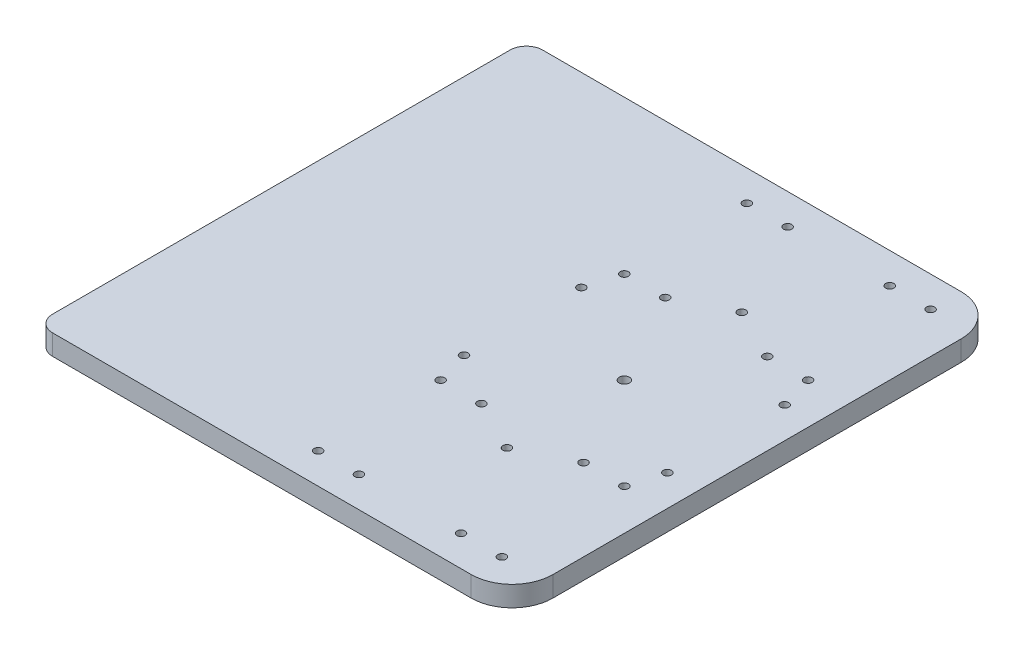
ISO-10303-21;
HEADER;
FILE_DESCRIPTION(('STEP AP214'),'2;1');
FILE_NAME('part.step','',(''),(''),'','','');
FILE_SCHEMA(('AUTOMOTIVE_DESIGN { 1 0 10303 214 1 1 1 1 }'));
ENDSEC;
DATA;
#1=APPLICATION_CONTEXT('core data for automotive mechanical design processes');
#2=APPLICATION_PROTOCOL_DEFINITION('international standard','automotive_design',2000,#1);
#3=PRODUCT_CONTEXT('',#1,'mechanical');
#4=PRODUCT('Part','Part','',(#3));
#5=PRODUCT_RELATED_PRODUCT_CATEGORY('part','',(#4));
#6=PRODUCT_DEFINITION_FORMATION('','',#4);
#7=PRODUCT_DEFINITION_CONTEXT('part definition',#1,'design');
#8=PRODUCT_DEFINITION('design','',#6,#7);
#9=PRODUCT_DEFINITION_SHAPE('','',#8);
#10=(LENGTH_UNIT() NAMED_UNIT(*) SI_UNIT(.MILLI.,.METRE.));
#11=(NAMED_UNIT(*) PLANE_ANGLE_UNIT() SI_UNIT($,.RADIAN.));
#12=(NAMED_UNIT(*) SI_UNIT($,.STERADIAN.) SOLID_ANGLE_UNIT());
#13=UNCERTAINTY_MEASURE_WITH_UNIT(LENGTH_MEASURE(1.E-05),#10,'distance_accuracy_value','');
#14=(GEOMETRIC_REPRESENTATION_CONTEXT(3) GLOBAL_UNCERTAINTY_ASSIGNED_CONTEXT((#13)) GLOBAL_UNIT_ASSIGNED_CONTEXT((#10,
#11,#12)) REPRESENTATION_CONTEXT('',''));
#15=CARTESIAN_POINT('',(0.,0.,0.));
#16=DIRECTION('',(0.,0.,1.));
#17=DIRECTION('',(1.,0.,0.));
#18=AXIS2_PLACEMENT_3D('',#15,#16,#17);
#19=CARTESIAN_POINT('',(-193.,10.,-100.));
#20=DIRECTION('',(0.,1.,0.));
#21=DIRECTION('',(0.,0.,1.));
#22=AXIS2_PLACEMENT_3D('',#19,#20,#21);
#23=PLANE('',#22);
#24=CARTESIAN_POINT('',(-25.,10.,105.));
#25=DIRECTION('',(0.,1.,0.));
#26=DIRECTION('',(0.,0.,-1.));
#27=AXIS2_PLACEMENT_3D('',#24,#25,#26);
#28=CIRCLE('',#27,2.00000000000001);
#29=CARTESIAN_POINT('',(-25.,10.,103.));
#30=VERTEX_POINT('',#29);
#31=EDGE_CURVE('E417',#30,#30,#28,.T.);
#32=ORIENTED_EDGE('',*,*,#31,.F.);
#33=EDGE_LOOP('',(#32));
#34=FACE_BOUND('',#33,.T.);
#35=CARTESIAN_POINT('',(45.,10.,105.));
#36=DIRECTION('',(0.,1.,0.));
#37=DIRECTION('',(0.,0.,-1.));
#38=AXIS2_PLACEMENT_3D('',#35,#36,#37);
#39=CIRCLE('',#38,2.);
#40=CARTESIAN_POINT('',(45.,10.,103.));
#41=VERTEX_POINT('',#40);
#42=EDGE_CURVE('E433',#41,#41,#39,.T.);
#43=ORIENTED_EDGE('',*,*,#42,.F.);
#44=EDGE_LOOP('',(#43));
#45=FACE_BOUND('',#44,.T.);
#46=CARTESIAN_POINT('',(25.,10.,45.));
#47=DIRECTION('',(0.,1.,0.));
#48=DIRECTION('',(0.,0.,-1.));
#49=AXIS2_PLACEMENT_3D('',#46,#47,#48);
#50=CIRCLE('',#49,2.00000000000001);
#51=CARTESIAN_POINT('',(25.,10.,43.));
#52=VERTEX_POINT('',#51);
#53=EDGE_CURVE('E447',#52,#52,#50,.T.);
#54=ORIENTED_EDGE('',*,*,#53,.F.);
#55=EDGE_LOOP('',(#54));
#56=FACE_BOUND('',#55,.T.);
#57=CARTESIAN_POINT('',(-45.,10.,45.));
#58=DIRECTION('',(0.,1.,0.));
#59=DIRECTION('',(0.,0.,-1.));
#60=AXIS2_PLACEMENT_3D('',#57,#58,#59);
#61=CIRCLE('',#60,2.);
#62=CARTESIAN_POINT('',(-45.,10.,43.));
#63=VERTEX_POINT('',#62);
#64=EDGE_CURVE('E461',#63,#63,#61,.T.);
#65=ORIENTED_EDGE('',*,*,#64,.F.);
#66=EDGE_LOOP('',(#65));
#67=FACE_BOUND('',#66,.T.);
#68=CARTESIAN_POINT('',(25.,10.,-45.));
#69=DIRECTION('',(0.,1.,0.));
#70=DIRECTION('',(0.,0.,1.));
#71=AXIS2_PLACEMENT_3D('',#68,#69,#70);
#72=CIRCLE('',#71,2.00000000000001);
#73=CARTESIAN_POINT('',(25.,10.,-43.));
#74=VERTEX_POINT('',#73);
#75=EDGE_CURVE('E475',#74,#74,#72,.T.);
#76=ORIENTED_EDGE('',*,*,#75,.F.);
#77=EDGE_LOOP('',(#76));
#78=FACE_BOUND('',#77,.T.);
#79=CARTESIAN_POINT('',(-45.,10.,-45.));
#80=DIRECTION('',(0.,1.,0.));
#81=DIRECTION('',(0.,0.,1.));
#82=AXIS2_PLACEMENT_3D('',#79,#80,#81);
#83=CIRCLE('',#82,2.);
#84=CARTESIAN_POINT('',(-45.,10.,-43.));
#85=VERTEX_POINT('',#84);
#86=EDGE_CURVE('E489',#85,#85,#83,.T.);
#87=ORIENTED_EDGE('',*,*,#86,.F.);
#88=EDGE_LOOP('',(#87));
#89=FACE_BOUND('',#88,.T.);
#90=CARTESIAN_POINT('',(25.,10.,-105.));
#91=DIRECTION('',(0.,1.,0.));
#92=DIRECTION('',(0.,0.,1.));
#93=AXIS2_PLACEMENT_3D('',#90,#91,#92);
#94=CIRCLE('',#93,2.00000000000001);
#95=CARTESIAN_POINT('',(25.,10.,-103.));
#96=VERTEX_POINT('',#95);
#97=EDGE_CURVE('E503',#96,#96,#94,.T.);
#98=ORIENTED_EDGE('',*,*,#97,.F.);
#99=EDGE_LOOP('',(#98));
#100=FACE_BOUND('',#99,.T.);
#101=CARTESIAN_POINT('',(-45.,10.,-105.));
#102=DIRECTION('',(0.,1.,0.));
#103=DIRECTION('',(0.,0.,1.));
#104=AXIS2_PLACEMENT_3D('',#101,#102,#103);
#105=CIRCLE('',#104,2.);
#106=CARTESIAN_POINT('',(-45.,10.,-103.));
#107=VERTEX_POINT('',#106);
#108=EDGE_CURVE('E517',#107,#107,#105,.T.);
#109=ORIENTED_EDGE('',*,*,#108,.F.);
#110=EDGE_LOOP('',(#109));
#111=FACE_BOUND('',#110,.T.);
#112=CARTESIAN_POINT('',(49.7964607176055,10.,-28.7499999999995));
#113=DIRECTION('',(0.,1.,0.));
#114=DIRECTION('',(0.,0.,1.));
#115=AXIS2_PLACEMENT_3D('',#112,#113,#114);
#116=CIRCLE('',#115,2.);
#117=CARTESIAN_POINT('',(49.7964607176055,10.,-26.7499999999995));
#118=VERTEX_POINT('',#117);
#119=EDGE_CURVE('E531',#118,#118,#116,.T.);
#120=ORIENTED_EDGE('',*,*,#119,.F.);
#121=EDGE_LOOP('',(#120));
#122=FACE_BOUND('',#121,.T.);
#123=CARTESIAN_POINT('',(-49.7964607176051,10.,-28.7500000000002));
#124=DIRECTION('',(0.,1.,0.));
#125=DIRECTION('',(0.,0.,1.));
#126=AXIS2_PLACEMENT_3D('',#123,#124,#125);
#127=CIRCLE('',#126,2.);
#128=CARTESIAN_POINT('',(-49.7964607176051,10.,-26.7500000000002));
#129=VERTEX_POINT('',#128);
#130=EDGE_CURVE('E545',#129,#129,#127,.T.);
#131=ORIENTED_EDGE('',*,*,#130,.F.);
#132=EDGE_LOOP('',(#131));
#133=FACE_BOUND('',#132,.T.);
#134=CARTESIAN_POINT('',(0.,10.,0.));
#135=DIRECTION('',(0.,1.,0.));
#136=DIRECTION('',(0.,0.,1.));
#137=AXIS2_PLACEMENT_3D('',#134,#135,#136);
#138=CIRCLE('',#137,2.5);
#139=CARTESIAN_POINT('',(0.,10.,2.5));
#140=VERTEX_POINT('',#139);
#141=EDGE_CURVE('E343',#140,#140,#138,.T.);
#142=ORIENTED_EDGE('',*,*,#141,.F.);
#143=EDGE_LOOP('',(#142));
#144=FACE_BOUND('',#143,.T.);
#145=CARTESIAN_POINT('',(0.,10.,57.5));
#146=DIRECTION('',(0.,1.,0.));
#147=DIRECTION('',(0.,0.,1.));
#148=AXIS2_PLACEMENT_3D('',#145,#146,#147);
#149=CIRCLE('',#148,2.);
#150=CARTESIAN_POINT('',(0.,10.,59.5));
#151=VERTEX_POINT('',#150);
#152=EDGE_CURVE('E144',#151,#151,#149,.T.);
#153=ORIENTED_EDGE('',*,*,#152,.F.);
#154=EDGE_LOOP('',(#153));
#155=FACE_BOUND('',#154,.T.);
#156=CARTESIAN_POINT('',(-49.7964607176053,10.,28.7499999999999));
#157=DIRECTION('',(0.,1.,0.));
#158=DIRECTION('',(0.,0.,1.));
#159=AXIS2_PLACEMENT_3D('',#156,#157,#158);
#160=CIRCLE('',#159,2.);
#161=CARTESIAN_POINT('',(-49.7964607176053,10.,30.7499999999999));
#162=VERTEX_POINT('',#161);
#163=EDGE_CURVE('E349',#162,#162,#160,.T.);
#164=ORIENTED_EDGE('',*,*,#163,.F.);
#165=EDGE_LOOP('',(#164));
#166=FACE_BOUND('',#165,.T.);
#167=CARTESIAN_POINT('',(4.0152035396696E-13,10.,-57.5));
#168=DIRECTION('',(0.,1.,0.));
#169=DIRECTION('',(0.,0.,1.));
#170=AXIS2_PLACEMENT_3D('',#167,#168,#169);
#171=CIRCLE('',#170,2.);
#172=CARTESIAN_POINT('',(4.0152035396696E-13,10.,-55.5));
#173=VERTEX_POINT('',#172);
#174=EDGE_CURVE('E375',#173,#173,#171,.T.);
#175=ORIENTED_EDGE('',*,*,#174,.F.);
#176=EDGE_LOOP('',(#175));
#177=FACE_BOUND('',#176,.T.);
#178=CARTESIAN_POINT('',(49.7964607176049,10.,28.7500000000006));
#179=DIRECTION('',(0.,1.,0.));
#180=DIRECTION('',(0.,0.,1.));
#181=AXIS2_PLACEMENT_3D('',#178,#179,#180);
#182=CIRCLE('',#181,2.);
#183=CARTESIAN_POINT('',(49.7964607176049,10.,30.7500000000006));
#184=VERTEX_POINT('',#183);
#185=EDGE_CURVE('E379',#184,#184,#182,.T.);
#186=ORIENTED_EDGE('',*,*,#185,.F.);
#187=EDGE_LOOP('',(#186));
#188=FACE_BOUND('',#187,.T.);
#189=CARTESIAN_POINT('',(-25.,10.,-105.));
#190=DIRECTION('',(0.,1.,0.));
#191=DIRECTION('',(0.,0.,1.));
#192=AXIS2_PLACEMENT_3D('',#189,#190,#191);
#193=CIRCLE('',#192,2.00000000000001);
#194=CARTESIAN_POINT('',(-25.,10.,-103.));
#195=VERTEX_POINT('',#194);
#196=EDGE_CURVE('E383',#195,#195,#193,.T.);
#197=ORIENTED_EDGE('',*,*,#196,.F.);
#198=EDGE_LOOP('',(#197));
#199=FACE_BOUND('',#198,.T.);
#200=CARTESIAN_POINT('',(45.,10.,-105.));
#201=DIRECTION('',(0.,1.,0.));
#202=DIRECTION('',(0.,0.,1.));
#203=AXIS2_PLACEMENT_3D('',#200,#201,#202);
#204=CIRCLE('',#203,2.);
#205=CARTESIAN_POINT('',(45.,10.,-103.));
#206=VERTEX_POINT('',#205);
#207=EDGE_CURVE('E387',#206,#206,#204,.T.);
#208=ORIENTED_EDGE('',*,*,#207,.F.);
#209=EDGE_LOOP('',(#208));
#210=FACE_BOUND('',#209,.T.);
#211=CARTESIAN_POINT('',(-25.,10.,-45.));
#212=DIRECTION('',(0.,1.,0.));
#213=DIRECTION('',(0.,0.,1.));
#214=AXIS2_PLACEMENT_3D('',#211,#212,#213);
#215=CIRCLE('',#214,2.00000000000001);
#216=CARTESIAN_POINT('',(-25.,10.,-43.));
#217=VERTEX_POINT('',#216);
#218=EDGE_CURVE('E391',#217,#217,#215,.T.);
#219=ORIENTED_EDGE('',*,*,#218,.F.);
#220=EDGE_LOOP('',(#219));
#221=FACE_BOUND('',#220,.T.);
#222=CARTESIAN_POINT('',(45.,10.,-45.));
#223=DIRECTION('',(0.,1.,0.));
#224=DIRECTION('',(0.,0.,1.));
#225=AXIS2_PLACEMENT_3D('',#222,#223,#224);
#226=CIRCLE('',#225,2.);
#227=CARTESIAN_POINT('',(45.,10.,-43.));
#228=VERTEX_POINT('',#227);
#229=EDGE_CURVE('E395',#228,#228,#226,.T.);
#230=ORIENTED_EDGE('',*,*,#229,.F.);
#231=EDGE_LOOP('',(#230));
#232=FACE_BOUND('',#231,.T.);
#233=CARTESIAN_POINT('',(-25.,10.,45.));
#234=DIRECTION('',(0.,1.,0.));
#235=DIRECTION('',(0.,0.,-1.));
#236=AXIS2_PLACEMENT_3D('',#233,#234,#235);
#237=CIRCLE('',#236,2.00000000000001);
#238=CARTESIAN_POINT('',(-25.,10.,43.));
#239=VERTEX_POINT('',#238);
#240=EDGE_CURVE('E399',#239,#239,#237,.T.);
#241=ORIENTED_EDGE('',*,*,#240,.F.);
#242=EDGE_LOOP('',(#241));
#243=FACE_BOUND('',#242,.T.);
#244=CARTESIAN_POINT('',(45.,10.,45.));
#245=DIRECTION('',(0.,1.,0.));
#246=DIRECTION('',(0.,0.,-1.));
#247=AXIS2_PLACEMENT_3D('',#244,#245,#246);
#248=CIRCLE('',#247,2.);
#249=CARTESIAN_POINT('',(45.,10.,43.));
#250=VERTEX_POINT('',#249);
#251=EDGE_CURVE('E403',#250,#250,#248,.T.);
#252=ORIENTED_EDGE('',*,*,#251,.F.);
#253=EDGE_LOOP('',(#252));
#254=FACE_BOUND('',#253,.T.);
#255=CARTESIAN_POINT('',(25.,10.,105.));
#256=DIRECTION('',(0.,1.,0.));
#257=DIRECTION('',(0.,0.,-1.));
#258=AXIS2_PLACEMENT_3D('',#255,#256,#257);
#259=CIRCLE('',#258,2.00000000000001);
#260=CARTESIAN_POINT('',(25.,10.,103.));
#261=VERTEX_POINT('',#260);
#262=EDGE_CURVE('E407',#261,#261,#259,.T.);
#263=ORIENTED_EDGE('',*,*,#262,.F.);
#264=EDGE_LOOP('',(#263));
#265=FACE_BOUND('',#264,.T.);
#266=CARTESIAN_POINT('',(-45.,10.,105.));
#267=DIRECTION('',(0.,1.,0.));
#268=DIRECTION('',(0.,0.,-1.));
#269=AXIS2_PLACEMENT_3D('',#266,#267,#268);
#270=CIRCLE('',#269,2.);
#271=CARTESIAN_POINT('',(-45.,10.,103.));
#272=VERTEX_POINT('',#271);
#273=EDGE_CURVE('E410',#272,#272,#270,.T.);
#274=ORIENTED_EDGE('',*,*,#273,.F.);
#275=EDGE_LOOP('',(#274));
#276=FACE_BOUND('',#275,.T.);
#277=DIRECTION('',(-1.,0.,0.));
#278=VECTOR('',#277,1.);
#279=CARTESIAN_POINT('',(-193.,10.,-120.));
#280=LINE('',#279,#278);
#281=CARTESIAN_POINT('',(45.,10.,-120.));
#282=VERTEX_POINT('',#281);
#283=CARTESIAN_POINT('',(-160.,10.,-120.));
#284=VERTEX_POINT('',#283);
#285=EDGE_CURVE('E137',#282,#284,#280,.T.);
#286=ORIENTED_EDGE('',*,*,#285,.T.);
#287=CARTESIAN_POINT('',(-160.,10.,-112.));
#288=DIRECTION('',(0.,1.,0.));
#289=DIRECTION('',(0.,0.,1.));
#290=AXIS2_PLACEMENT_3D('',#287,#288,#289);
#291=CIRCLE('',#290,8.);
#292=CARTESIAN_POINT('',(-168.,10.,-112.));
#293=VERTEX_POINT('',#292);
#294=EDGE_CURVE('E48',#284,#293,#291,.T.);
#295=ORIENTED_EDGE('',*,*,#294,.T.);
#296=DIRECTION('',(0.,0.,-1.));
#297=VECTOR('',#296,1.);
#298=CARTESIAN_POINT('',(-168.,10.,-120.));
#299=LINE('',#298,#297);
#300=CARTESIAN_POINT('',(-168.,10.,112.));
#301=VERTEX_POINT('',#300);
#302=EDGE_CURVE('E183',#301,#293,#299,.T.);
#303=ORIENTED_EDGE('',*,*,#302,.F.);
#304=CARTESIAN_POINT('',(-160.,10.,112.));
#305=DIRECTION('',(0.,1.,0.));
#306=DIRECTION('',(0.,0.,1.));
#307=AXIS2_PLACEMENT_3D('',#304,#305,#306);
#308=CIRCLE('',#307,8.);
#309=CARTESIAN_POINT('',(-160.,10.,120.));
#310=VERTEX_POINT('',#309);
#311=EDGE_CURVE('E55',#301,#310,#308,.T.);
#312=ORIENTED_EDGE('',*,*,#311,.T.);
#313=DIRECTION('',(1.,0.,0.));
#314=VECTOR('',#313,1.);
#315=CARTESIAN_POINT('',(45.,10.,120.));
#316=LINE('',#315,#314);
#317=CARTESIAN_POINT('',(45.,10.,120.));
#318=VERTEX_POINT('',#317);
#319=EDGE_CURVE('E103',#310,#318,#316,.T.);
#320=ORIENTED_EDGE('',*,*,#319,.T.);
#321=CARTESIAN_POINT('',(45.,10.,100.));
#322=DIRECTION('',(0.,1.,0.));
#323=DIRECTION('',(0.,0.,-1.));
#324=AXIS2_PLACEMENT_3D('',#321,#322,#323);
#325=CIRCLE('',#324,20.);
#326=CARTESIAN_POINT('',(65.,10.,100.));
#327=VERTEX_POINT('',#326);
#328=EDGE_CURVE('E106',#318,#327,#325,.T.);
#329=ORIENTED_EDGE('',*,*,#328,.T.);
#330=DIRECTION('',(0.,0.,-1.));
#331=VECTOR('',#330,1.);
#332=CARTESIAN_POINT('',(65.,10.,-100.));
#333=LINE('',#332,#331);
#334=CARTESIAN_POINT('',(65.,10.,-100.));
#335=VERTEX_POINT('',#334);
#336=EDGE_CURVE('E128',#327,#335,#333,.T.);
#337=ORIENTED_EDGE('',*,*,#336,.T.);
#338=CARTESIAN_POINT('',(45.,10.,-100.));
#339=DIRECTION('',(0.,1.,0.));
#340=DIRECTION('',(0.,0.,1.));
#341=AXIS2_PLACEMENT_3D('',#338,#339,#340);
#342=CIRCLE('',#341,20.);
#343=EDGE_CURVE('E131',#335,#282,#342,.T.);
#344=ORIENTED_EDGE('',*,*,#343,.T.);
#345=EDGE_LOOP('',(#286,#295,#303,#312,#320,#329,#337,#344));
#346=FACE_BOUND('',#345,.T.);
#347=ADVANCED_FACE('F39',(#34,#45,#56,#67,#78,#89,#100,#111,#122,#133,#144,#155,#166,#177,#188,
#199,#210,#221,#232,#243,#254,#265,#276,#346),#23,.T.);
#348=CARTESIAN_POINT('',(-193.,0.,-100.));
#349=DIRECTION('',(0.,1.,0.));
#350=DIRECTION('',(0.,0.,1.));
#351=AXIS2_PLACEMENT_3D('',#348,#349,#350);
#352=PLANE('',#351);
#353=CARTESIAN_POINT('',(-45.,0.,105.));
#354=DIRECTION('',(0.,1.,0.));
#355=DIRECTION('',(0.,0.,-1.));
#356=AXIS2_PLACEMENT_3D('',#353,#354,#355);
#357=CIRCLE('',#356,2.);
#358=CARTESIAN_POINT('',(-45.,0.,103.));
#359=VERTEX_POINT('',#358);
#360=EDGE_CURVE('E192',#359,#359,#357,.T.);
#361=ORIENTED_EDGE('',*,*,#360,.T.);
#362=EDGE_LOOP('',(#361));
#363=FACE_BOUND('',#362,.T.);
#364=CARTESIAN_POINT('',(-25.,0.,105.));
#365=DIRECTION('',(0.,1.,0.));
#366=DIRECTION('',(0.,0.,-1.));
#367=AXIS2_PLACEMENT_3D('',#364,#365,#366);
#368=CIRCLE('',#367,2.00000000000001);
#369=CARTESIAN_POINT('',(-25.,0.,103.));
#370=VERTEX_POINT('',#369);
#371=EDGE_CURVE('E412',#370,#370,#368,.T.);
#372=ORIENTED_EDGE('',*,*,#371,.T.);
#373=EDGE_LOOP('',(#372));
#374=FACE_BOUND('',#373,.T.);
#375=CARTESIAN_POINT('',(25.,0.,105.));
#376=DIRECTION('',(0.,1.,0.));
#377=DIRECTION('',(0.,0.,-1.));
#378=AXIS2_PLACEMENT_3D('',#375,#376,#377);
#379=CIRCLE('',#378,2.00000000000001);
#380=CARTESIAN_POINT('',(25.,0.,103.));
#381=VERTEX_POINT('',#380);
#382=EDGE_CURVE('E425',#381,#381,#379,.T.);
#383=ORIENTED_EDGE('',*,*,#382,.T.);
#384=EDGE_LOOP('',(#383));
#385=FACE_BOUND('',#384,.T.);
#386=CARTESIAN_POINT('',(45.,0.,105.));
#387=DIRECTION('',(0.,1.,0.));
#388=DIRECTION('',(0.,0.,-1.));
#389=AXIS2_PLACEMENT_3D('',#386,#387,#388);
#390=CIRCLE('',#389,2.);
#391=CARTESIAN_POINT('',(45.,0.,103.));
#392=VERTEX_POINT('',#391);
#393=EDGE_CURVE('E429',#392,#392,#390,.T.);
#394=ORIENTED_EDGE('',*,*,#393,.T.);
#395=EDGE_LOOP('',(#394));
#396=FACE_BOUND('',#395,.T.);
#397=CARTESIAN_POINT('',(45.,0.,45.));
#398=DIRECTION('',(0.,1.,0.));
#399=DIRECTION('',(0.,0.,-1.));
#400=AXIS2_PLACEMENT_3D('',#397,#398,#399);
#401=CIRCLE('',#400,2.);
#402=CARTESIAN_POINT('',(45.,0.,43.));
#403=VERTEX_POINT('',#402);
#404=EDGE_CURVE('E437',#403,#403,#401,.T.);
#405=ORIENTED_EDGE('',*,*,#404,.T.);
#406=EDGE_LOOP('',(#405));
#407=FACE_BOUND('',#406,.T.);
#408=CARTESIAN_POINT('',(25.,0.,45.));
#409=DIRECTION('',(0.,1.,0.));
#410=DIRECTION('',(0.,0.,-1.));
#411=AXIS2_PLACEMENT_3D('',#408,#409,#410);
#412=CIRCLE('',#411,2.00000000000001);
#413=CARTESIAN_POINT('',(25.,0.,43.));
#414=VERTEX_POINT('',#413);
#415=EDGE_CURVE('E443',#414,#414,#412,.T.);
#416=ORIENTED_EDGE('',*,*,#415,.T.);
#417=EDGE_LOOP('',(#416));
#418=FACE_BOUND('',#417,.T.);
#419=CARTESIAN_POINT('',(-25.,0.,45.));
#420=DIRECTION('',(0.,1.,0.));
#421=DIRECTION('',(0.,0.,-1.));
#422=AXIS2_PLACEMENT_3D('',#419,#420,#421);
#423=CIRCLE('',#422,2.00000000000001);
#424=CARTESIAN_POINT('',(-25.,0.,43.));
#425=VERTEX_POINT('',#424);
#426=EDGE_CURVE('E451',#425,#425,#423,.T.);
#427=ORIENTED_EDGE('',*,*,#426,.T.);
#428=EDGE_LOOP('',(#427));
#429=FACE_BOUND('',#428,.T.);
#430=CARTESIAN_POINT('',(-45.,0.,45.));
#431=DIRECTION('',(0.,1.,0.));
#432=DIRECTION('',(0.,0.,-1.));
#433=AXIS2_PLACEMENT_3D('',#430,#431,#432);
#434=CIRCLE('',#433,2.);
#435=CARTESIAN_POINT('',(-45.,0.,43.));
#436=VERTEX_POINT('',#435);
#437=EDGE_CURVE('E457',#436,#436,#434,.T.);
#438=ORIENTED_EDGE('',*,*,#437,.T.);
#439=EDGE_LOOP('',(#438));
#440=FACE_BOUND('',#439,.T.);
#441=CARTESIAN_POINT('',(45.,0.,-45.));
#442=DIRECTION('',(0.,1.,0.));
#443=DIRECTION('',(0.,0.,1.));
#444=AXIS2_PLACEMENT_3D('',#441,#442,#443);
#445=CIRCLE('',#444,2.);
#446=CARTESIAN_POINT('',(45.,0.,-43.));
#447=VERTEX_POINT('',#446);
#448=EDGE_CURVE('E465',#447,#447,#445,.T.);
#449=ORIENTED_EDGE('',*,*,#448,.T.);
#450=EDGE_LOOP('',(#449));
#451=FACE_BOUND('',#450,.T.);
#452=CARTESIAN_POINT('',(25.,0.,-45.));
#453=DIRECTION('',(0.,1.,0.));
#454=DIRECTION('',(0.,0.,1.));
#455=AXIS2_PLACEMENT_3D('',#452,#453,#454);
#456=CIRCLE('',#455,2.00000000000001);
#457=CARTESIAN_POINT('',(25.,0.,-43.));
#458=VERTEX_POINT('',#457);
#459=EDGE_CURVE('E471',#458,#458,#456,.T.);
#460=ORIENTED_EDGE('',*,*,#459,.T.);
#461=EDGE_LOOP('',(#460));
#462=FACE_BOUND('',#461,.T.);
#463=CARTESIAN_POINT('',(-25.,0.,-45.));
#464=DIRECTION('',(0.,1.,0.));
#465=DIRECTION('',(0.,0.,1.));
#466=AXIS2_PLACEMENT_3D('',#463,#464,#465);
#467=CIRCLE('',#466,2.00000000000001);
#468=CARTESIAN_POINT('',(-25.,0.,-43.));
#469=VERTEX_POINT('',#468);
#470=EDGE_CURVE('E479',#469,#469,#467,.T.);
#471=ORIENTED_EDGE('',*,*,#470,.T.);
#472=EDGE_LOOP('',(#471));
#473=FACE_BOUND('',#472,.T.);
#474=CARTESIAN_POINT('',(-45.,0.,-45.));
#475=DIRECTION('',(0.,1.,0.));
#476=DIRECTION('',(0.,0.,1.));
#477=AXIS2_PLACEMENT_3D('',#474,#475,#476);
#478=CIRCLE('',#477,2.);
#479=CARTESIAN_POINT('',(-45.,0.,-43.));
#480=VERTEX_POINT('',#479);
#481=EDGE_CURVE('E485',#480,#480,#478,.T.);
#482=ORIENTED_EDGE('',*,*,#481,.T.);
#483=EDGE_LOOP('',(#482));
#484=FACE_BOUND('',#483,.T.);
#485=CARTESIAN_POINT('',(45.,0.,-105.));
#486=DIRECTION('',(0.,1.,0.));
#487=DIRECTION('',(0.,0.,1.));
#488=AXIS2_PLACEMENT_3D('',#485,#486,#487);
#489=CIRCLE('',#488,2.);
#490=CARTESIAN_POINT('',(45.,0.,-103.));
#491=VERTEX_POINT('',#490);
#492=EDGE_CURVE('E493',#491,#491,#489,.T.);
#493=ORIENTED_EDGE('',*,*,#492,.T.);
#494=EDGE_LOOP('',(#493));
#495=FACE_BOUND('',#494,.T.);
#496=CARTESIAN_POINT('',(25.,0.,-105.));
#497=DIRECTION('',(0.,1.,0.));
#498=DIRECTION('',(0.,0.,1.));
#499=AXIS2_PLACEMENT_3D('',#496,#497,#498);
#500=CIRCLE('',#499,2.00000000000001);
#501=CARTESIAN_POINT('',(25.,0.,-103.));
#502=VERTEX_POINT('',#501);
#503=EDGE_CURVE('E499',#502,#502,#500,.T.);
#504=ORIENTED_EDGE('',*,*,#503,.T.);
#505=EDGE_LOOP('',(#504));
#506=FACE_BOUND('',#505,.T.);
#507=CARTESIAN_POINT('',(-25.,0.,-105.));
#508=DIRECTION('',(0.,1.,0.));
#509=DIRECTION('',(0.,0.,1.));
#510=AXIS2_PLACEMENT_3D('',#507,#508,#509);
#511=CIRCLE('',#510,2.00000000000001);
#512=CARTESIAN_POINT('',(-25.,0.,-103.));
#513=VERTEX_POINT('',#512);
#514=EDGE_CURVE('E507',#513,#513,#511,.T.);
#515=ORIENTED_EDGE('',*,*,#514,.T.);
#516=EDGE_LOOP('',(#515));
#517=FACE_BOUND('',#516,.T.);
#518=CARTESIAN_POINT('',(-45.,0.,-105.));
#519=DIRECTION('',(0.,1.,0.));
#520=DIRECTION('',(0.,0.,1.));
#521=AXIS2_PLACEMENT_3D('',#518,#519,#520);
#522=CIRCLE('',#521,2.);
#523=CARTESIAN_POINT('',(-45.,0.,-103.));
#524=VERTEX_POINT('',#523);
#525=EDGE_CURVE('E513',#524,#524,#522,.T.);
#526=ORIENTED_EDGE('',*,*,#525,.T.);
#527=EDGE_LOOP('',(#526));
#528=FACE_BOUND('',#527,.T.);
#529=CARTESIAN_POINT('',(49.7964607176049,0.,28.7500000000006));
#530=DIRECTION('',(0.,1.,0.));
#531=DIRECTION('',(0.,0.,1.));
#532=AXIS2_PLACEMENT_3D('',#529,#530,#531);
#533=CIRCLE('',#532,2.);
#534=CARTESIAN_POINT('',(49.7964607176049,0.,30.7500000000006));
#535=VERTEX_POINT('',#534);
#536=EDGE_CURVE('E521',#535,#535,#533,.T.);
#537=ORIENTED_EDGE('',*,*,#536,.T.);
#538=EDGE_LOOP('',(#537));
#539=FACE_BOUND('',#538,.T.);
#540=CARTESIAN_POINT('',(49.7964607176055,0.,-28.7499999999995));
#541=DIRECTION('',(0.,1.,0.));
#542=DIRECTION('',(0.,0.,1.));
#543=AXIS2_PLACEMENT_3D('',#540,#541,#542);
#544=CIRCLE('',#543,2.);
#545=CARTESIAN_POINT('',(49.7964607176055,0.,-26.7499999999995));
#546=VERTEX_POINT('',#545);
#547=EDGE_CURVE('E527',#546,#546,#544,.T.);
#548=ORIENTED_EDGE('',*,*,#547,.T.);
#549=EDGE_LOOP('',(#548));
#550=FACE_BOUND('',#549,.T.);
#551=CARTESIAN_POINT('',(4.0152035396696E-13,0.,-57.5));
#552=DIRECTION('',(0.,1.,0.));
#553=DIRECTION('',(0.,0.,1.));
#554=AXIS2_PLACEMENT_3D('',#551,#552,#553);
#555=CIRCLE('',#554,2.);
#556=CARTESIAN_POINT('',(4.0152035396696E-13,0.,-55.5));
#557=VERTEX_POINT('',#556);
#558=EDGE_CURVE('E535',#557,#557,#555,.T.);
#559=ORIENTED_EDGE('',*,*,#558,.T.);
#560=EDGE_LOOP('',(#559));
#561=FACE_BOUND('',#560,.T.);
#562=CARTESIAN_POINT('',(-49.7964607176051,0.,-28.7500000000002));
#563=DIRECTION('',(0.,1.,0.));
#564=DIRECTION('',(0.,0.,1.));
#565=AXIS2_PLACEMENT_3D('',#562,#563,#564);
#566=CIRCLE('',#565,2.);
#567=CARTESIAN_POINT('',(-49.7964607176051,0.,-26.7500000000002));
#568=VERTEX_POINT('',#567);
#569=EDGE_CURVE('E541',#568,#568,#566,.T.);
#570=ORIENTED_EDGE('',*,*,#569,.T.);
#571=EDGE_LOOP('',(#570));
#572=FACE_BOUND('',#571,.T.);
#573=CARTESIAN_POINT('',(-49.7964607176053,0.,28.7499999999999));
#574=DIRECTION('',(0.,1.,0.));
#575=DIRECTION('',(0.,0.,1.));
#576=AXIS2_PLACEMENT_3D('',#573,#574,#575);
#577=CIRCLE('',#576,2.);
#578=CARTESIAN_POINT('',(-49.7964607176053,0.,30.7499999999999));
#579=VERTEX_POINT('',#578);
#580=EDGE_CURVE('E356',#579,#579,#577,.T.);
#581=ORIENTED_EDGE('',*,*,#580,.T.);
#582=EDGE_LOOP('',(#581));
#583=FACE_BOUND('',#582,.T.);
#584=CARTESIAN_POINT('',(0.,0.,0.));
#585=DIRECTION('',(0.,1.,0.));
#586=DIRECTION('',(0.,0.,1.));
#587=AXIS2_PLACEMENT_3D('',#584,#585,#586);
#588=CIRCLE('',#587,2.5);
#589=CARTESIAN_POINT('',(0.,0.,2.5));
#590=VERTEX_POINT('',#589);
#591=EDGE_CURVE('E346',#590,#590,#588,.T.);
#592=ORIENTED_EDGE('',*,*,#591,.T.);
#593=EDGE_LOOP('',(#592));
#594=FACE_BOUND('',#593,.T.);
#595=CARTESIAN_POINT('',(0.,0.,57.5));
#596=DIRECTION('',(0.,1.,0.));
#597=DIRECTION('',(0.,0.,1.));
#598=AXIS2_PLACEMENT_3D('',#595,#596,#597);
#599=CIRCLE('',#598,2.);
#600=CARTESIAN_POINT('',(0.,0.,59.5));
#601=VERTEX_POINT('',#600);
#602=EDGE_CURVE('E353',#601,#601,#599,.T.);
#603=ORIENTED_EDGE('',*,*,#602,.T.);
#604=EDGE_LOOP('',(#603));
#605=FACE_BOUND('',#604,.T.);
#606=DIRECTION('',(0.,0.,1.));
#607=VECTOR('',#606,1.);
#608=CARTESIAN_POINT('',(-168.,0.,-120.));
#609=LINE('',#608,#607);
#610=CARTESIAN_POINT('',(-168.,0.,-112.));
#611=VERTEX_POINT('',#610);
#612=CARTESIAN_POINT('',(-168.,0.,112.));
#613=VERTEX_POINT('',#612);
#614=EDGE_CURVE('E193',#611,#613,#609,.T.);
#615=ORIENTED_EDGE('',*,*,#614,.F.);
#616=CARTESIAN_POINT('',(-160.,0.,-112.));
#617=DIRECTION('',(0.,1.,0.));
#618=DIRECTION('',(0.,0.,1.));
#619=AXIS2_PLACEMENT_3D('',#616,#617,#618);
#620=CIRCLE('',#619,8.);
#621=CARTESIAN_POINT('',(-160.,0.,-120.));
#622=VERTEX_POINT('',#621);
#623=EDGE_CURVE('E174',#611,#622,#620,.F.);
#624=ORIENTED_EDGE('',*,*,#623,.T.);
#625=DIRECTION('',(-1.,0.,0.));
#626=VECTOR('',#625,1.);
#627=CARTESIAN_POINT('',(-193.,0.,-120.));
#628=LINE('',#627,#626);
#629=CARTESIAN_POINT('',(45.,0.,-120.));
#630=VERTEX_POINT('',#629);
#631=EDGE_CURVE('E111',#630,#622,#628,.T.);
#632=ORIENTED_EDGE('',*,*,#631,.F.);
#633=CARTESIAN_POINT('',(45.,0.,-100.));
#634=DIRECTION('',(0.,1.,0.));
#635=DIRECTION('',(0.,0.,1.));
#636=AXIS2_PLACEMENT_3D('',#633,#634,#635);
#637=CIRCLE('',#636,20.);
#638=CARTESIAN_POINT('',(65.,0.,-100.));
#639=VERTEX_POINT('',#638);
#640=EDGE_CURVE('E150',#639,#630,#637,.T.);
#641=ORIENTED_EDGE('',*,*,#640,.F.);
#642=DIRECTION('',(0.,0.,-1.));
#643=VECTOR('',#642,1.);
#644=CARTESIAN_POINT('',(65.,0.,-100.));
#645=LINE('',#644,#643);
#646=CARTESIAN_POINT('',(65.,0.,100.));
#647=VERTEX_POINT('',#646);
#648=EDGE_CURVE('E147',#647,#639,#645,.T.);
#649=ORIENTED_EDGE('',*,*,#648,.F.);
#650=CARTESIAN_POINT('',(45.,0.,100.));
#651=DIRECTION('',(0.,1.,0.));
#652=DIRECTION('',(0.,0.,-1.));
#653=AXIS2_PLACEMENT_3D('',#650,#651,#652);
#654=CIRCLE('',#653,20.);
#655=CARTESIAN_POINT('',(45.,0.,120.));
#656=VERTEX_POINT('',#655);
#657=EDGE_CURVE('E143',#656,#647,#654,.T.);
#658=ORIENTED_EDGE('',*,*,#657,.F.);
#659=DIRECTION('',(1.,0.,0.));
#660=VECTOR('',#659,1.);
#661=CARTESIAN_POINT('',(45.,0.,120.));
#662=LINE('',#661,#660);
#663=CARTESIAN_POINT('',(-160.,0.,120.));
#664=VERTEX_POINT('',#663);
#665=EDGE_CURVE('E117',#664,#656,#662,.T.);
#666=ORIENTED_EDGE('',*,*,#665,.F.);
#667=CARTESIAN_POINT('',(-160.,0.,112.));
#668=DIRECTION('',(0.,1.,0.));
#669=DIRECTION('',(0.,0.,1.));
#670=AXIS2_PLACEMENT_3D('',#667,#668,#669);
#671=CIRCLE('',#670,8.);
#672=EDGE_CURVE('E171',#664,#613,#671,.F.);
#673=ORIENTED_EDGE('',*,*,#672,.T.);
#674=EDGE_LOOP('',(#615,#624,#632,#641,#649,#658,#666,#673));
#675=FACE_BOUND('',#674,.T.);
#676=ADVANCED_FACE('F198',(#363,#374,#385,#396,#407,#418,#429,#440,#451,#462,#473,#484,#495,
#506,#517,#528,#539,#550,#561,#572,#583,#594,#605,#675),#352,.F.);
#677=CARTESIAN_POINT('',(45.,10.,120.));
#678=DIRECTION('',(0.,0.,-1.));
#679=DIRECTION('',(-1.,0.,0.));
#680=AXIS2_PLACEMENT_3D('',#677,#678,#679);
#681=PLANE('',#680);
#682=ORIENTED_EDGE('',*,*,#319,.F.);
#683=DIRECTION('',(0.,1.,0.));
#684=VECTOR('',#683,1.);
#685=CARTESIAN_POINT('',(-160.,0.,120.));
#686=LINE('',#685,#684);
#687=EDGE_CURVE('E11',#310,#664,#686,.F.);
#688=ORIENTED_EDGE('',*,*,#687,.T.);
#689=ORIENTED_EDGE('',*,*,#665,.T.);
#690=DIRECTION('',(0.,-1.,0.));
#691=VECTOR('',#690,1.);
#692=CARTESIAN_POINT('',(45.,10.,120.));
#693=LINE('',#692,#691);
#694=EDGE_CURVE('E114',#318,#656,#693,.T.);
#695=ORIENTED_EDGE('',*,*,#694,.F.);
#696=EDGE_LOOP('',(#682,#688,#689,#695));
#697=FACE_BOUND('',#696,.T.);
#698=ADVANCED_FACE('F115',(#697),#681,.F.);
#699=CARTESIAN_POINT('',(-193.,10.,-120.));
#700=DIRECTION('',(0.,0.,1.));
#701=DIRECTION('',(1.,0.,0.));
#702=AXIS2_PLACEMENT_3D('',#699,#700,#701);
#703=PLANE('',#702);
#704=ORIENTED_EDGE('',*,*,#631,.T.);
#705=DIRECTION('',(0.,-1.,0.));
#706=VECTOR('',#705,1.);
#707=CARTESIAN_POINT('',(-160.,10.,-120.));
#708=LINE('',#707,#706);
#709=EDGE_CURVE('E63',#622,#284,#708,.F.);
#710=ORIENTED_EDGE('',*,*,#709,.T.);
#711=ORIENTED_EDGE('',*,*,#285,.F.);
#712=DIRECTION('',(0.,-1.,0.));
#713=VECTOR('',#712,1.);
#714=CARTESIAN_POINT('',(45.,10.,-120.));
#715=LINE('',#714,#713);
#716=EDGE_CURVE('E140',#282,#630,#715,.T.);
#717=ORIENTED_EDGE('',*,*,#716,.T.);
#718=EDGE_LOOP('',(#704,#710,#711,#717));
#719=FACE_BOUND('',#718,.T.);
#720=ADVANCED_FACE('F200',(#719),#703,.F.);
#721=CARTESIAN_POINT('',(45.,10.,100.));
#722=DIRECTION('',(0.,-1.,0.));
#723=DIRECTION('',(0.,0.,-1.));
#724=AXIS2_PLACEMENT_3D('',#721,#722,#723);
#725=CYLINDRICAL_SURFACE('',#724,20.);
#726=ORIENTED_EDGE('',*,*,#657,.T.);
#727=DIRECTION('',(0.,-1.,0.));
#728=VECTOR('',#727,1.);
#729=CARTESIAN_POINT('',(65.,10.,100.));
#730=LINE('',#729,#728);
#731=EDGE_CURVE('E122',#327,#647,#730,.T.);
#732=ORIENTED_EDGE('',*,*,#731,.F.);
#733=ORIENTED_EDGE('',*,*,#328,.F.);
#734=ORIENTED_EDGE('',*,*,#694,.T.);
#735=EDGE_LOOP('',(#726,#732,#733,#734));
#736=FACE_BOUND('',#735,.T.);
#737=ADVANCED_FACE('F124',(#736),#725,.T.);
#738=CARTESIAN_POINT('',(65.,10.,-100.));
#739=DIRECTION('',(-1.,0.,0.));
#740=DIRECTION('',(0.,0.,1.));
#741=AXIS2_PLACEMENT_3D('',#738,#739,#740);
#742=PLANE('',#741);
#743=ORIENTED_EDGE('',*,*,#648,.T.);
#744=DIRECTION('',(0.,-1.,0.));
#745=VECTOR('',#744,1.);
#746=CARTESIAN_POINT('',(65.,10.,-100.));
#747=LINE('',#746,#745);
#748=EDGE_CURVE('E158',#335,#639,#747,.T.);
#749=ORIENTED_EDGE('',*,*,#748,.F.);
#750=ORIENTED_EDGE('',*,*,#336,.F.);
#751=ORIENTED_EDGE('',*,*,#731,.T.);
#752=EDGE_LOOP('',(#743,#749,#750,#751));
#753=FACE_BOUND('',#752,.T.);
#754=ADVANCED_FACE('F208',(#753),#742,.F.);
#755=CARTESIAN_POINT('',(45.,10.,-100.));
#756=DIRECTION('',(0.,-1.,0.));
#757=DIRECTION('',(0.,0.,-1.));
#758=AXIS2_PLACEMENT_3D('',#755,#756,#757);
#759=CYLINDRICAL_SURFACE('',#758,20.);
#760=ORIENTED_EDGE('',*,*,#640,.T.);
#761=ORIENTED_EDGE('',*,*,#716,.F.);
#762=ORIENTED_EDGE('',*,*,#343,.F.);
#763=ORIENTED_EDGE('',*,*,#748,.T.);
#764=EDGE_LOOP('',(#760,#761,#762,#763));
#765=FACE_BOUND('',#764,.T.);
#766=ADVANCED_FACE('F204',(#765),#759,.T.);
#767=CARTESIAN_POINT('',(0.,10.,57.5));
#768=DIRECTION('',(0.,-1.,0.));
#769=DIRECTION('',(0.,0.,-1.));
#770=AXIS2_PLACEMENT_3D('',#767,#768,#769);
#771=CYLINDRICAL_SURFACE('',#770,2.);
#772=ORIENTED_EDGE('',*,*,#152,.T.);
#773=EDGE_LOOP('',(#772));
#774=FACE_BOUND('',#773,.T.);
#775=ORIENTED_EDGE('',*,*,#602,.F.);
#776=EDGE_LOOP('',(#775));
#777=FACE_BOUND('',#776,.T.);
#778=ADVANCED_FACE('F215',(#774,#777),#771,.F.);
#779=CARTESIAN_POINT('',(0.,10.,0.));
#780=DIRECTION('',(0.,-1.,0.));
#781=DIRECTION('',(0.,0.,-1.));
#782=AXIS2_PLACEMENT_3D('',#779,#780,#781);
#783=CYLINDRICAL_SURFACE('',#782,2.5);
#784=ORIENTED_EDGE('',*,*,#141,.T.);
#785=EDGE_LOOP('',(#784));
#786=FACE_BOUND('',#785,.T.);
#787=ORIENTED_EDGE('',*,*,#591,.F.);
#788=EDGE_LOOP('',(#787));
#789=FACE_BOUND('',#788,.T.);
#790=ADVANCED_FACE('F332',(#786,#789),#783,.F.);
#791=CARTESIAN_POINT('',(-49.7964607176053,10.,28.7499999999999));
#792=DIRECTION('',(0.,-1.,0.));
#793=DIRECTION('',(0.,0.,-1.));
#794=AXIS2_PLACEMENT_3D('',#791,#792,#793);
#795=CYLINDRICAL_SURFACE('',#794,2.);
#796=ORIENTED_EDGE('',*,*,#163,.T.);
#797=EDGE_LOOP('',(#796));
#798=FACE_BOUND('',#797,.T.);
#799=ORIENTED_EDGE('',*,*,#580,.F.);
#800=EDGE_LOOP('',(#799));
#801=FACE_BOUND('',#800,.T.);
#802=ADVANCED_FACE('F329',(#798,#801),#795,.F.);
#803=CARTESIAN_POINT('',(-49.7964607176051,10.,-28.7500000000002));
#804=DIRECTION('',(0.,-1.,0.));
#805=DIRECTION('',(0.,0.,-1.));
#806=AXIS2_PLACEMENT_3D('',#803,#804,#805);
#807=CYLINDRICAL_SURFACE('',#806,2.);
#808=ORIENTED_EDGE('',*,*,#130,.T.);
#809=EDGE_LOOP('',(#808));
#810=FACE_BOUND('',#809,.T.);
#811=ORIENTED_EDGE('',*,*,#569,.F.);
#812=EDGE_LOOP('',(#811));
#813=FACE_BOUND('',#812,.T.);
#814=ADVANCED_FACE('F325',(#810,#813),#807,.F.);
#815=CARTESIAN_POINT('',(4.0152035396696E-13,10.,-57.5));
#816=DIRECTION('',(0.,-1.,0.));
#817=DIRECTION('',(0.,0.,-1.));
#818=AXIS2_PLACEMENT_3D('',#815,#816,#817);
#819=CYLINDRICAL_SURFACE('',#818,2.);
#820=ORIENTED_EDGE('',*,*,#174,.T.);
#821=EDGE_LOOP('',(#820));
#822=FACE_BOUND('',#821,.T.);
#823=ORIENTED_EDGE('',*,*,#558,.F.);
#824=EDGE_LOOP('',(#823));
#825=FACE_BOUND('',#824,.T.);
#826=ADVANCED_FACE('F321',(#822,#825),#819,.F.);
#827=CARTESIAN_POINT('',(49.7964607176055,10.,-28.7499999999995));
#828=DIRECTION('',(0.,-1.,0.));
#829=DIRECTION('',(0.,0.,-1.));
#830=AXIS2_PLACEMENT_3D('',#827,#828,#829);
#831=CYLINDRICAL_SURFACE('',#830,2.);
#832=ORIENTED_EDGE('',*,*,#119,.T.);
#833=EDGE_LOOP('',(#832));
#834=FACE_BOUND('',#833,.T.);
#835=ORIENTED_EDGE('',*,*,#547,.F.);
#836=EDGE_LOOP('',(#835));
#837=FACE_BOUND('',#836,.T.);
#838=ADVANCED_FACE('F317',(#834,#837),#831,.F.);
#839=CARTESIAN_POINT('',(49.7964607176049,10.,28.7500000000006));
#840=DIRECTION('',(0.,-1.,0.));
#841=DIRECTION('',(0.,0.,-1.));
#842=AXIS2_PLACEMENT_3D('',#839,#840,#841);
#843=CYLINDRICAL_SURFACE('',#842,2.);
#844=ORIENTED_EDGE('',*,*,#185,.T.);
#845=EDGE_LOOP('',(#844));
#846=FACE_BOUND('',#845,.T.);
#847=ORIENTED_EDGE('',*,*,#536,.F.);
#848=EDGE_LOOP('',(#847));
#849=FACE_BOUND('',#848,.T.);
#850=ADVANCED_FACE('F313',(#846,#849),#843,.F.);
#851=CARTESIAN_POINT('',(-45.,10.,-105.));
#852=DIRECTION('',(0.,-1.,0.));
#853=DIRECTION('',(0.,0.,-1.));
#854=AXIS2_PLACEMENT_3D('',#851,#852,#853);
#855=CYLINDRICAL_SURFACE('',#854,2.);
#856=ORIENTED_EDGE('',*,*,#108,.T.);
#857=EDGE_LOOP('',(#856));
#858=FACE_BOUND('',#857,.T.);
#859=ORIENTED_EDGE('',*,*,#525,.F.);
#860=EDGE_LOOP('',(#859));
#861=FACE_BOUND('',#860,.T.);
#862=ADVANCED_FACE('F309',(#858,#861),#855,.F.);
#863=CARTESIAN_POINT('',(-25.,10.,-105.));
#864=DIRECTION('',(0.,-1.,0.));
#865=DIRECTION('',(0.,0.,-1.));
#866=AXIS2_PLACEMENT_3D('',#863,#864,#865);
#867=CYLINDRICAL_SURFACE('',#866,2.00000000000001);
#868=ORIENTED_EDGE('',*,*,#196,.T.);
#869=EDGE_LOOP('',(#868));
#870=FACE_BOUND('',#869,.T.);
#871=ORIENTED_EDGE('',*,*,#514,.F.);
#872=EDGE_LOOP('',(#871));
#873=FACE_BOUND('',#872,.T.);
#874=ADVANCED_FACE('F305',(#870,#873),#867,.F.);
#875=CARTESIAN_POINT('',(25.,10.,-105.));
#876=DIRECTION('',(0.,-1.,0.));
#877=DIRECTION('',(0.,0.,-1.));
#878=AXIS2_PLACEMENT_3D('',#875,#876,#877);
#879=CYLINDRICAL_SURFACE('',#878,2.00000000000001);
#880=ORIENTED_EDGE('',*,*,#97,.T.);
#881=EDGE_LOOP('',(#880));
#882=FACE_BOUND('',#881,.T.);
#883=ORIENTED_EDGE('',*,*,#503,.F.);
#884=EDGE_LOOP('',(#883));
#885=FACE_BOUND('',#884,.T.);
#886=ADVANCED_FACE('F301',(#882,#885),#879,.F.);
#887=CARTESIAN_POINT('',(45.,10.,-105.));
#888=DIRECTION('',(0.,-1.,0.));
#889=DIRECTION('',(0.,0.,-1.));
#890=AXIS2_PLACEMENT_3D('',#887,#888,#889);
#891=CYLINDRICAL_SURFACE('',#890,2.);
#892=ORIENTED_EDGE('',*,*,#207,.T.);
#893=EDGE_LOOP('',(#892));
#894=FACE_BOUND('',#893,.T.);
#895=ORIENTED_EDGE('',*,*,#492,.F.);
#896=EDGE_LOOP('',(#895));
#897=FACE_BOUND('',#896,.T.);
#898=ADVANCED_FACE('F297',(#894,#897),#891,.F.);
#899=CARTESIAN_POINT('',(-45.,10.,-45.));
#900=DIRECTION('',(0.,-1.,0.));
#901=DIRECTION('',(0.,0.,-1.));
#902=AXIS2_PLACEMENT_3D('',#899,#900,#901);
#903=CYLINDRICAL_SURFACE('',#902,2.);
#904=ORIENTED_EDGE('',*,*,#86,.T.);
#905=EDGE_LOOP('',(#904));
#906=FACE_BOUND('',#905,.T.);
#907=ORIENTED_EDGE('',*,*,#481,.F.);
#908=EDGE_LOOP('',(#907));
#909=FACE_BOUND('',#908,.T.);
#910=ADVANCED_FACE('F293',(#906,#909),#903,.F.);
#911=CARTESIAN_POINT('',(-25.,10.,-45.));
#912=DIRECTION('',(0.,-1.,0.));
#913=DIRECTION('',(0.,0.,-1.));
#914=AXIS2_PLACEMENT_3D('',#911,#912,#913);
#915=CYLINDRICAL_SURFACE('',#914,2.00000000000001);
#916=ORIENTED_EDGE('',*,*,#218,.T.);
#917=EDGE_LOOP('',(#916));
#918=FACE_BOUND('',#917,.T.);
#919=ORIENTED_EDGE('',*,*,#470,.F.);
#920=EDGE_LOOP('',(#919));
#921=FACE_BOUND('',#920,.T.);
#922=ADVANCED_FACE('F289',(#918,#921),#915,.F.);
#923=CARTESIAN_POINT('',(25.,10.,-45.));
#924=DIRECTION('',(0.,-1.,0.));
#925=DIRECTION('',(0.,0.,-1.));
#926=AXIS2_PLACEMENT_3D('',#923,#924,#925);
#927=CYLINDRICAL_SURFACE('',#926,2.00000000000001);
#928=ORIENTED_EDGE('',*,*,#75,.T.);
#929=EDGE_LOOP('',(#928));
#930=FACE_BOUND('',#929,.T.);
#931=ORIENTED_EDGE('',*,*,#459,.F.);
#932=EDGE_LOOP('',(#931));
#933=FACE_BOUND('',#932,.T.);
#934=ADVANCED_FACE('F285',(#930,#933),#927,.F.);
#935=CARTESIAN_POINT('',(45.,10.,-45.));
#936=DIRECTION('',(0.,-1.,0.));
#937=DIRECTION('',(0.,0.,-1.));
#938=AXIS2_PLACEMENT_3D('',#935,#936,#937);
#939=CYLINDRICAL_SURFACE('',#938,2.);
#940=ORIENTED_EDGE('',*,*,#229,.T.);
#941=EDGE_LOOP('',(#940));
#942=FACE_BOUND('',#941,.T.);
#943=ORIENTED_EDGE('',*,*,#448,.F.);
#944=EDGE_LOOP('',(#943));
#945=FACE_BOUND('',#944,.T.);
#946=ADVANCED_FACE('F281',(#942,#945),#939,.F.);
#947=CARTESIAN_POINT('',(-45.,10.,45.));
#948=DIRECTION('',(0.,-1.,0.));
#949=DIRECTION('',(0.,0.,-1.));
#950=AXIS2_PLACEMENT_3D('',#947,#948,#949);
#951=CYLINDRICAL_SURFACE('',#950,2.);
#952=ORIENTED_EDGE('',*,*,#64,.T.);
#953=EDGE_LOOP('',(#952));
#954=FACE_BOUND('',#953,.T.);
#955=ORIENTED_EDGE('',*,*,#437,.F.);
#956=EDGE_LOOP('',(#955));
#957=FACE_BOUND('',#956,.T.);
#958=ADVANCED_FACE('F277',(#954,#957),#951,.F.);
#959=CARTESIAN_POINT('',(-25.,10.,45.));
#960=DIRECTION('',(0.,-1.,0.));
#961=DIRECTION('',(0.,0.,-1.));
#962=AXIS2_PLACEMENT_3D('',#959,#960,#961);
#963=CYLINDRICAL_SURFACE('',#962,2.00000000000001);
#964=ORIENTED_EDGE('',*,*,#240,.T.);
#965=EDGE_LOOP('',(#964));
#966=FACE_BOUND('',#965,.T.);
#967=ORIENTED_EDGE('',*,*,#426,.F.);
#968=EDGE_LOOP('',(#967));
#969=FACE_BOUND('',#968,.T.);
#970=ADVANCED_FACE('F273',(#966,#969),#963,.F.);
#971=CARTESIAN_POINT('',(25.,10.,45.));
#972=DIRECTION('',(0.,-1.,0.));
#973=DIRECTION('',(0.,0.,-1.));
#974=AXIS2_PLACEMENT_3D('',#971,#972,#973);
#975=CYLINDRICAL_SURFACE('',#974,2.00000000000001);
#976=ORIENTED_EDGE('',*,*,#53,.T.);
#977=EDGE_LOOP('',(#976));
#978=FACE_BOUND('',#977,.T.);
#979=ORIENTED_EDGE('',*,*,#415,.F.);
#980=EDGE_LOOP('',(#979));
#981=FACE_BOUND('',#980,.T.);
#982=ADVANCED_FACE('F269',(#978,#981),#975,.F.);
#983=CARTESIAN_POINT('',(45.,10.,45.));
#984=DIRECTION('',(0.,-1.,0.));
#985=DIRECTION('',(0.,0.,-1.));
#986=AXIS2_PLACEMENT_3D('',#983,#984,#985);
#987=CYLINDRICAL_SURFACE('',#986,2.);
#988=ORIENTED_EDGE('',*,*,#251,.T.);
#989=EDGE_LOOP('',(#988));
#990=FACE_BOUND('',#989,.T.);
#991=ORIENTED_EDGE('',*,*,#404,.F.);
#992=EDGE_LOOP('',(#991));
#993=FACE_BOUND('',#992,.T.);
#994=ADVANCED_FACE('F265',(#990,#993),#987,.F.);
#995=CARTESIAN_POINT('',(45.,10.,105.));
#996=DIRECTION('',(0.,-1.,0.));
#997=DIRECTION('',(0.,0.,-1.));
#998=AXIS2_PLACEMENT_3D('',#995,#996,#997);
#999=CYLINDRICAL_SURFACE('',#998,2.);
#1000=ORIENTED_EDGE('',*,*,#42,.T.);
#1001=EDGE_LOOP('',(#1000));
#1002=FACE_BOUND('',#1001,.T.);
#1003=ORIENTED_EDGE('',*,*,#393,.F.);
#1004=EDGE_LOOP('',(#1003));
#1005=FACE_BOUND('',#1004,.T.);
#1006=ADVANCED_FACE('F261',(#1002,#1005),#999,.F.);
#1007=CARTESIAN_POINT('',(25.,10.,105.));
#1008=DIRECTION('',(0.,-1.,0.));
#1009=DIRECTION('',(0.,0.,-1.));
#1010=AXIS2_PLACEMENT_3D('',#1007,#1008,#1009);
#1011=CYLINDRICAL_SURFACE('',#1010,2.00000000000001);
#1012=ORIENTED_EDGE('',*,*,#262,.T.);
#1013=EDGE_LOOP('',(#1012));
#1014=FACE_BOUND('',#1013,.T.);
#1015=ORIENTED_EDGE('',*,*,#382,.F.);
#1016=EDGE_LOOP('',(#1015));
#1017=FACE_BOUND('',#1016,.T.);
#1018=ADVANCED_FACE('F257',(#1014,#1017),#1011,.F.);
#1019=CARTESIAN_POINT('',(-25.,10.,105.));
#1020=DIRECTION('',(0.,-1.,0.));
#1021=DIRECTION('',(0.,0.,-1.));
#1022=AXIS2_PLACEMENT_3D('',#1019,#1020,#1021);
#1023=CYLINDRICAL_SURFACE('',#1022,2.00000000000001);
#1024=ORIENTED_EDGE('',*,*,#31,.T.);
#1025=EDGE_LOOP('',(#1024));
#1026=FACE_BOUND('',#1025,.T.);
#1027=ORIENTED_EDGE('',*,*,#371,.F.);
#1028=EDGE_LOOP('',(#1027));
#1029=FACE_BOUND('',#1028,.T.);
#1030=ADVANCED_FACE('F251',(#1026,#1029),#1023,.F.);
#1031=CARTESIAN_POINT('',(-45.,10.,105.));
#1032=DIRECTION('',(0.,-1.,0.));
#1033=DIRECTION('',(0.,0.,-1.));
#1034=AXIS2_PLACEMENT_3D('',#1031,#1032,#1033);
#1035=CYLINDRICAL_SURFACE('',#1034,2.);
#1036=ORIENTED_EDGE('',*,*,#273,.T.);
#1037=EDGE_LOOP('',(#1036));
#1038=FACE_BOUND('',#1037,.T.);
#1039=ORIENTED_EDGE('',*,*,#360,.F.);
#1040=EDGE_LOOP('',(#1039));
#1041=FACE_BOUND('',#1040,.T.);
#1042=ADVANCED_FACE('F246',(#1038,#1041),#1035,.F.);
#1043=CARTESIAN_POINT('',(-168.,0.,0.));
#1044=DIRECTION('',(-1.,0.,0.));
#1045=DIRECTION('',(0.,0.,1.));
#1046=AXIS2_PLACEMENT_3D('',#1043,#1044,#1045);
#1047=PLANE('',#1046);
#1048=ORIENTED_EDGE('',*,*,#302,.T.);
#1049=DIRECTION('',(0.,-1.,0.));
#1050=VECTOR('',#1049,1.);
#1051=CARTESIAN_POINT('',(-168.,0.,-112.));
#1052=LINE('',#1051,#1050);
#1053=EDGE_CURVE('E167',#293,#611,#1052,.T.);
#1054=ORIENTED_EDGE('',*,*,#1053,.T.);
#1055=ORIENTED_EDGE('',*,*,#614,.T.);
#1056=DIRECTION('',(0.,1.,0.));
#1057=VECTOR('',#1056,1.);
#1058=CARTESIAN_POINT('',(-168.,10.,112.));
#1059=LINE('',#1058,#1057);
#1060=EDGE_CURVE('E121',#613,#301,#1059,.T.);
#1061=ORIENTED_EDGE('',*,*,#1060,.T.);
#1062=EDGE_LOOP('',(#1048,#1054,#1055,#1061));
#1063=FACE_BOUND('',#1062,.T.);
#1064=ADVANCED_FACE('F187',(#1063),#1047,.T.);
#1065=CARTESIAN_POINT('',(-160.,0.,-112.));
#1066=DIRECTION('',(0.,1.,0.));
#1067=DIRECTION('',(0.,0.,1.));
#1068=AXIS2_PLACEMENT_3D('',#1065,#1066,#1067);
#1069=CYLINDRICAL_SURFACE('',#1068,8.);
#1070=ORIENTED_EDGE('',*,*,#294,.F.);
#1071=ORIENTED_EDGE('',*,*,#709,.F.);
#1072=ORIENTED_EDGE('',*,*,#623,.F.);
#1073=ORIENTED_EDGE('',*,*,#1053,.F.);
#1074=EDGE_LOOP('',(#1070,#1071,#1072,#1073));
#1075=FACE_BOUND('',#1074,.T.);
#1076=ADVANCED_FACE('F195',(#1075),#1069,.T.);
#1077=CARTESIAN_POINT('',(-160.,0.,112.));
#1078=DIRECTION('',(0.,-1.,0.));
#1079=DIRECTION('',(0.,0.,-1.));
#1080=AXIS2_PLACEMENT_3D('',#1077,#1078,#1079);
#1081=CYLINDRICAL_SURFACE('',#1080,8.);
#1082=ORIENTED_EDGE('',*,*,#672,.F.);
#1083=ORIENTED_EDGE('',*,*,#687,.F.);
#1084=ORIENTED_EDGE('',*,*,#311,.F.);
#1085=ORIENTED_EDGE('',*,*,#1060,.F.);
#1086=EDGE_LOOP('',(#1082,#1083,#1084,#1085));
#1087=FACE_BOUND('',#1086,.T.);
#1088=ADVANCED_FACE('F41',(#1087),#1081,.T.);
#1089=CLOSED_SHELL('',(#347,#676,#698,#720,#737,#754,#766,#778,#790,#802,#814,#826,#838,#850,
#862,#874,#886,#898,#910,#922,#934,#946,#958,#970,#982,#994,#1006,#1018,#1030,#1042,#1064,#1076,#1088));
#1090=MANIFOLD_SOLID_BREP('B2',#1089);
#1091=ADVANCED_BREP_SHAPE_REPRESENTATION('',(#18,#1090),#14);
#1092=SHAPE_DEFINITION_REPRESENTATION(#9,#1091);
ENDSEC;
END-ISO-10303-21;
